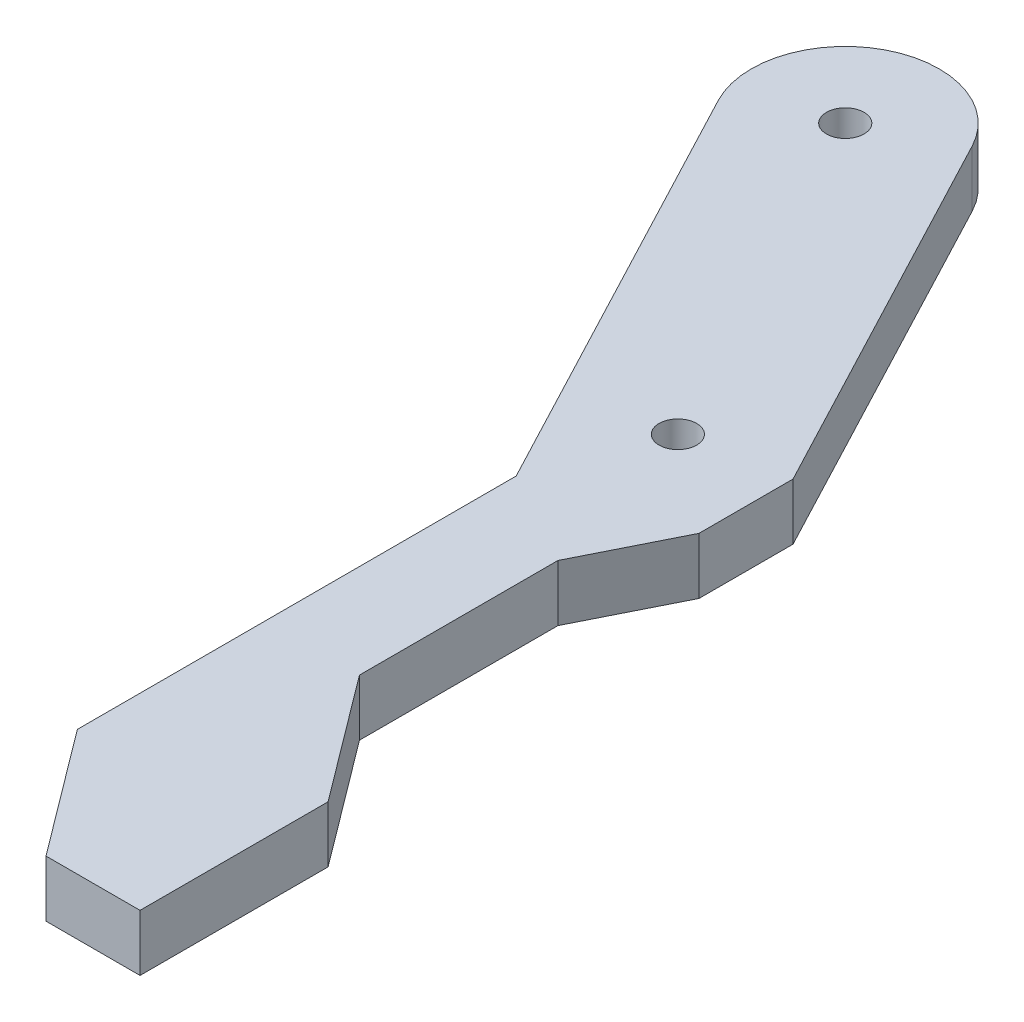
ISO-10303-21;
HEADER;
FILE_DESCRIPTION(('STEP AP214'),'2;1');
FILE_NAME('part.step','',(''),(''),'','','');
FILE_SCHEMA(('AUTOMOTIVE_DESIGN { 1 0 10303 214 1 1 1 1 }'));
ENDSEC;
DATA;
#1=APPLICATION_CONTEXT('core data for automotive mechanical design processes');
#2=APPLICATION_PROTOCOL_DEFINITION('international standard','automotive_design',2000,#1);
#3=PRODUCT_CONTEXT('',#1,'mechanical');
#4=PRODUCT('Part','Part','',(#3));
#5=PRODUCT_RELATED_PRODUCT_CATEGORY('part','',(#4));
#6=PRODUCT_DEFINITION_FORMATION('','',#4);
#7=PRODUCT_DEFINITION_CONTEXT('part definition',#1,'design');
#8=PRODUCT_DEFINITION('design','',#6,#7);
#9=PRODUCT_DEFINITION_SHAPE('','',#8);
#10=(LENGTH_UNIT() NAMED_UNIT(*) SI_UNIT(.MILLI.,.METRE.));
#11=(NAMED_UNIT(*) PLANE_ANGLE_UNIT() SI_UNIT($,.RADIAN.));
#12=(NAMED_UNIT(*) SI_UNIT($,.STERADIAN.) SOLID_ANGLE_UNIT());
#13=UNCERTAINTY_MEASURE_WITH_UNIT(LENGTH_MEASURE(1.E-05),#10,'distance_accuracy_value','');
#14=(GEOMETRIC_REPRESENTATION_CONTEXT(3) GLOBAL_UNCERTAINTY_ASSIGNED_CONTEXT((#13)) GLOBAL_UNIT_ASSIGNED_CONTEXT((#10,
#11,#12)) REPRESENTATION_CONTEXT('',''));
#15=CARTESIAN_POINT('',(0.,0.,0.));
#16=DIRECTION('',(0.,0.,1.));
#17=DIRECTION('',(1.,0.,0.));
#18=AXIS2_PLACEMENT_3D('',#15,#16,#17);
#19=CARTESIAN_POINT('',(2.49500776591133,3.,-24.5552704801839));
#20=DIRECTION('',(0.,1.,0.));
#21=DIRECTION('',(0.,0.,1.));
#22=AXIS2_PLACEMENT_3D('',#19,#20,#21);
#23=PLANE('',#22);
#24=CARTESIAN_POINT('',(12.3715323829315,3.,-5.77782737382026));
#25=DIRECTION('',(0.,1.,0.));
#26=DIRECTION('',(0.,0.,1.));
#27=AXIS2_PLACEMENT_3D('',#24,#25,#26);
#28=CIRCLE('',#27,1.);
#29=CARTESIAN_POINT('',(12.3715323829315,3.,-4.77782737382026));
#30=VERTEX_POINT('',#29);
#31=EDGE_CURVE('E152',#30,#30,#28,.T.);
#32=ORIENTED_EDGE('',*,*,#31,.F.);
#33=EDGE_LOOP('',(#32));
#34=FACE_BOUND('',#33,.T.);
#35=CARTESIAN_POINT('',(2.49500776591133,3.,-24.5552704801839));
#36=DIRECTION('',(0.,1.,0.));
#37=DIRECTION('',(0.,0.,1.));
#38=AXIS2_PLACEMENT_3D('',#35,#36,#37);
#39=CIRCLE('',#38,5.);
#40=CARTESIAN_POINT('',(6.92021453928729,3.,-26.8828325121967));
#41=VERTEX_POINT('',#40);
#42=CARTESIAN_POINT('',(-1.93019900746463,3.,-22.2277084481711));
#43=VERTEX_POINT('',#42);
#44=EDGE_CURVE('E169',#41,#43,#39,.T.);
#45=ORIENTED_EDGE('',*,*,#44,.T.);
#46=DIRECTION('',(0.465512406402558,0.,0.885041354675193));
#47=VECTOR('',#46,1.);
#48=CARTESIAN_POINT('',(-1.93019900746463,3.,-22.2277084481711));
#49=LINE('',#48,#47);
#50=CARTESIAN_POINT('',(9.99500776591133,3.,0.444729519816103));
#51=VERTEX_POINT('',#50);
#52=EDGE_CURVE('E102',#43,#51,#49,.T.);
#53=ORIENTED_EDGE('',*,*,#52,.T.);
#54=DIRECTION('',(0.,0.,1.));
#55=VECTOR('',#54,1.);
#56=CARTESIAN_POINT('',(9.99500776591133,3.,0.444729519816103));
#57=LINE('',#56,#55);
#58=CARTESIAN_POINT('',(9.99500776591134,3.,23.7780628531494));
#59=VERTEX_POINT('',#58);
#60=EDGE_CURVE('E193',#51,#59,#57,.T.);
#61=ORIENTED_EDGE('',*,*,#60,.T.);
#62=DIRECTION('',(0.6,0.,0.8));
#63=VECTOR('',#62,1.);
#64=CARTESIAN_POINT('',(9.99500776591134,3.,23.7780628531494));
#65=LINE('',#64,#63);
#66=CARTESIAN_POINT('',(14.9950077659113,3.,30.4447295198161));
#67=VERTEX_POINT('',#66);
#68=EDGE_CURVE('E212',#59,#67,#65,.T.);
#69=ORIENTED_EDGE('',*,*,#68,.T.);
#70=DIRECTION('',(1.,0.,0.));
#71=VECTOR('',#70,1.);
#72=CARTESIAN_POINT('',(14.9950077659113,3.,30.4447295198161));
#73=LINE('',#72,#71);
#74=CARTESIAN_POINT('',(19.9950077659113,3.,30.4447295198161));
#75=VERTEX_POINT('',#74);
#76=EDGE_CURVE('E209',#67,#75,#73,.T.);
#77=ORIENTED_EDGE('',*,*,#76,.T.);
#78=DIRECTION('',(0.,0.,-1.));
#79=VECTOR('',#78,1.);
#80=CARTESIAN_POINT('',(19.9950077659113,3.,30.4447295198161));
#81=LINE('',#80,#79);
#82=CARTESIAN_POINT('',(19.9950077659113,3.,20.4447295198161));
#83=VERTEX_POINT('',#82);
#84=EDGE_CURVE('E211',#75,#83,#81,.T.);
#85=ORIENTED_EDGE('',*,*,#84,.T.);
#86=DIRECTION('',(-0.6,0.,-0.8));
#87=VECTOR('',#86,1.);
#88=CARTESIAN_POINT('',(14.9950077659113,3.,13.7780628531494));
#89=LINE('',#88,#87);
#90=CARTESIAN_POINT('',(14.9950077659113,3.,13.7780628531494));
#91=VERTEX_POINT('',#90);
#92=EDGE_CURVE('E214',#83,#91,#89,.T.);
#93=ORIENTED_EDGE('',*,*,#92,.T.);
#94=DIRECTION('',(0.,0.,-1.));
#95=VECTOR('',#94,1.);
#96=CARTESIAN_POINT('',(14.9950077659113,3.,3.22217262617973));
#97=LINE('',#96,#95);
#98=CARTESIAN_POINT('',(14.9950077659113,3.,3.22217262617973));
#99=VERTEX_POINT('',#98);
#100=EDGE_CURVE('E130',#91,#99,#97,.T.);
#101=ORIENTED_EDGE('',*,*,#100,.T.);
#102=DIRECTION('',(0.447213595499958,0.,-0.894427190999916));
#103=VECTOR('',#102,1.);
#104=CARTESIAN_POINT('',(17.4950077659113,3.,-1.77782737382027));
#105=LINE('',#104,#103);
#106=CARTESIAN_POINT('',(17.4950077659113,3.,-1.77782737382027));
#107=VERTEX_POINT('',#106);
#108=EDGE_CURVE('E124',#99,#107,#105,.T.);
#109=ORIENTED_EDGE('',*,*,#108,.T.);
#110=DIRECTION('',(0.,0.,-1.));
#111=VECTOR('',#110,1.);
#112=CARTESIAN_POINT('',(17.4950077659113,3.,-6.77782737382027));
#113=LINE('',#112,#111);
#114=CARTESIAN_POINT('',(17.4950077659113,3.,-6.77782737382027));
#115=VERTEX_POINT('',#114);
#116=EDGE_CURVE('E128',#107,#115,#113,.T.);
#117=ORIENTED_EDGE('',*,*,#116,.T.);
#118=DIRECTION('',(-0.465512406402558,0.,-0.885041354675193));
#119=VECTOR('',#118,1.);
#120=CARTESIAN_POINT('',(6.92021453928729,3.,-26.8828325121967));
#121=LINE('',#120,#119);
#122=EDGE_CURVE('E50',#115,#41,#121,.T.);
#123=ORIENTED_EDGE('',*,*,#122,.T.);
#124=EDGE_LOOP('',(#45,#53,#61,#69,#77,#85,#93,#101,#109,#117,#123));
#125=FACE_BOUND('',#124,.T.);
#126=CARTESIAN_POINT('',(2.49500776591133,3.,-24.5552704801839));
#127=DIRECTION('',(0.,1.,0.));
#128=DIRECTION('',(0.,0.,1.));
#129=AXIS2_PLACEMENT_3D('',#126,#127,#128);
#130=CIRCLE('',#129,1.);
#131=CARTESIAN_POINT('',(2.49500776591133,3.,-23.5552704801839));
#132=VERTEX_POINT('',#131);
#133=EDGE_CURVE('E260',#132,#132,#130,.T.);
#134=ORIENTED_EDGE('',*,*,#133,.F.);
#135=EDGE_LOOP('',(#134));
#136=FACE_BOUND('',#135,.T.);
#137=ADVANCED_FACE('F33',(#34,#125,#136),#23,.T.);
#138=CARTESIAN_POINT('',(2.49500776591133,0.,-24.5552704801839));
#139=DIRECTION('',(0.,1.,0.));
#140=DIRECTION('',(0.,0.,1.));
#141=AXIS2_PLACEMENT_3D('',#138,#139,#140);
#142=PLANE('',#141);
#143=CARTESIAN_POINT('',(12.3715323829315,0.,-5.77782737382026));
#144=DIRECTION('',(0.,1.,0.));
#145=DIRECTION('',(0.,0.,1.));
#146=AXIS2_PLACEMENT_3D('',#143,#144,#145);
#147=CIRCLE('',#146,1.);
#148=CARTESIAN_POINT('',(12.3715323829315,0.,-4.77782737382026));
#149=VERTEX_POINT('',#148);
#150=EDGE_CURVE('E265',#149,#149,#147,.T.);
#151=ORIENTED_EDGE('',*,*,#150,.T.);
#152=EDGE_LOOP('',(#151));
#153=FACE_BOUND('',#152,.T.);
#154=CARTESIAN_POINT('',(2.49500776591133,0.,-24.5552704801839));
#155=DIRECTION('',(0.,1.,0.));
#156=DIRECTION('',(0.,0.,1.));
#157=AXIS2_PLACEMENT_3D('',#154,#155,#156);
#158=CIRCLE('',#157,5.);
#159=CARTESIAN_POINT('',(6.92021453928729,0.,-26.8828325121967));
#160=VERTEX_POINT('',#159);
#161=CARTESIAN_POINT('',(-1.93019900746463,0.,-22.2277084481711));
#162=VERTEX_POINT('',#161);
#163=EDGE_CURVE('E148',#160,#162,#158,.T.);
#164=ORIENTED_EDGE('',*,*,#163,.F.);
#165=DIRECTION('',(-0.465512406402558,0.,-0.885041354675193));
#166=VECTOR('',#165,1.);
#167=CARTESIAN_POINT('',(6.92021453928729,0.,-26.8828325121967));
#168=LINE('',#167,#166);
#169=CARTESIAN_POINT('',(17.4950077659113,0.,-6.77782737382027));
#170=VERTEX_POINT('',#169);
#171=EDGE_CURVE('E94',#170,#160,#168,.T.);
#172=ORIENTED_EDGE('',*,*,#171,.F.);
#173=DIRECTION('',(0.,0.,-1.));
#174=VECTOR('',#173,1.);
#175=CARTESIAN_POINT('',(17.4950077659113,0.,-6.77782737382027));
#176=LINE('',#175,#174);
#177=CARTESIAN_POINT('',(17.4950077659113,0.,-1.77782737382027));
#178=VERTEX_POINT('',#177);
#179=EDGE_CURVE('E88',#178,#170,#176,.T.);
#180=ORIENTED_EDGE('',*,*,#179,.F.);
#181=DIRECTION('',(0.447213595499958,0.,-0.894427190999916));
#182=VECTOR('',#181,1.);
#183=CARTESIAN_POINT('',(17.4950077659113,0.,-1.77782737382027));
#184=LINE('',#183,#182);
#185=CARTESIAN_POINT('',(14.9950077659113,0.,3.22217262617973));
#186=VERTEX_POINT('',#185);
#187=EDGE_CURVE('E138',#186,#178,#184,.T.);
#188=ORIENTED_EDGE('',*,*,#187,.F.);
#189=DIRECTION('',(0.,0.,-1.));
#190=VECTOR('',#189,1.);
#191=CARTESIAN_POINT('',(14.9950077659113,0.,3.22217262617973));
#192=LINE('',#191,#190);
#193=CARTESIAN_POINT('',(14.9950077659113,0.,13.7780628531494));
#194=VERTEX_POINT('',#193);
#195=EDGE_CURVE('E164',#194,#186,#192,.T.);
#196=ORIENTED_EDGE('',*,*,#195,.F.);
#197=DIRECTION('',(-0.6,0.,-0.8));
#198=VECTOR('',#197,1.);
#199=CARTESIAN_POINT('',(14.9950077659113,0.,13.7780628531494));
#200=LINE('',#199,#198);
#201=CARTESIAN_POINT('',(19.9950077659113,0.,20.4447295198161));
#202=VERTEX_POINT('',#201);
#203=EDGE_CURVE('E162',#202,#194,#200,.T.);
#204=ORIENTED_EDGE('',*,*,#203,.F.);
#205=DIRECTION('',(0.,0.,-1.));
#206=VECTOR('',#205,1.);
#207=CARTESIAN_POINT('',(19.9950077659113,0.,30.4447295198161));
#208=LINE('',#207,#206);
#209=CARTESIAN_POINT('',(19.9950077659113,0.,30.4447295198161));
#210=VERTEX_POINT('',#209);
#211=EDGE_CURVE('E160',#210,#202,#208,.T.);
#212=ORIENTED_EDGE('',*,*,#211,.F.);
#213=DIRECTION('',(1.,0.,0.));
#214=VECTOR('',#213,1.);
#215=CARTESIAN_POINT('',(14.9950077659113,0.,30.4447295198161));
#216=LINE('',#215,#214);
#217=CARTESIAN_POINT('',(14.9950077659113,0.,30.4447295198161));
#218=VERTEX_POINT('',#217);
#219=EDGE_CURVE('E158',#218,#210,#216,.T.);
#220=ORIENTED_EDGE('',*,*,#219,.F.);
#221=DIRECTION('',(0.6,0.,0.8));
#222=VECTOR('',#221,1.);
#223=CARTESIAN_POINT('',(9.99500776591134,0.,23.7780628531494));
#224=LINE('',#223,#222);
#225=CARTESIAN_POINT('',(9.99500776591134,0.,23.7780628531494));
#226=VERTEX_POINT('',#225);
#227=EDGE_CURVE('E156',#226,#218,#224,.T.);
#228=ORIENTED_EDGE('',*,*,#227,.F.);
#229=DIRECTION('',(0.,0.,1.));
#230=VECTOR('',#229,1.);
#231=CARTESIAN_POINT('',(9.99500776591133,0.,0.444729519816103));
#232=LINE('',#231,#230);
#233=CARTESIAN_POINT('',(9.99500776591133,0.,0.444729519816103));
#234=VERTEX_POINT('',#233);
#235=EDGE_CURVE('E154',#234,#226,#232,.T.);
#236=ORIENTED_EDGE('',*,*,#235,.F.);
#237=DIRECTION('',(0.465512406402558,0.,0.885041354675193));
#238=VECTOR('',#237,1.);
#239=CARTESIAN_POINT('',(-1.93019900746463,0.,-22.2277084481711));
#240=LINE('',#239,#238);
#241=EDGE_CURVE('E151',#162,#234,#240,.T.);
#242=ORIENTED_EDGE('',*,*,#241,.F.);
#243=EDGE_LOOP('',(#164,#172,#180,#188,#196,#204,#212,#220,#228,#236,#242));
#244=FACE_BOUND('',#243,.T.);
#245=CARTESIAN_POINT('',(2.49500776591133,0.,-24.5552704801839));
#246=DIRECTION('',(0.,1.,0.));
#247=DIRECTION('',(0.,0.,1.));
#248=AXIS2_PLACEMENT_3D('',#245,#246,#247);
#249=CIRCLE('',#248,1.);
#250=CARTESIAN_POINT('',(2.49500776591133,0.,-23.5552704801839));
#251=VERTEX_POINT('',#250);
#252=EDGE_CURVE('E263',#251,#251,#249,.T.);
#253=ORIENTED_EDGE('',*,*,#252,.T.);
#254=EDGE_LOOP('',(#253));
#255=FACE_BOUND('',#254,.T.);
#256=ADVANCED_FACE('F197',(#153,#244,#255),#142,.F.);
#257=CARTESIAN_POINT('',(2.49500776591133,3.,-24.5552704801839));
#258=DIRECTION('',(0.,-1.,0.));
#259=DIRECTION('',(0.,0.,-1.));
#260=AXIS2_PLACEMENT_3D('',#257,#258,#259);
#261=CYLINDRICAL_SURFACE('',#260,5.);
#262=ORIENTED_EDGE('',*,*,#163,.T.);
#263=DIRECTION('',(0.,-1.,0.));
#264=VECTOR('',#263,1.);
#265=CARTESIAN_POINT('',(-1.93019900746463,3.,-22.2277084481711));
#266=LINE('',#265,#264);
#267=EDGE_CURVE('E11',#43,#162,#266,.T.);
#268=ORIENTED_EDGE('',*,*,#267,.F.);
#269=ORIENTED_EDGE('',*,*,#44,.F.);
#270=DIRECTION('',(0.,-1.,0.));
#271=VECTOR('',#270,1.);
#272=CARTESIAN_POINT('',(6.92021453928729,3.,-26.8828325121967));
#273=LINE('',#272,#271);
#274=EDGE_CURVE('E144',#41,#160,#273,.T.);
#275=ORIENTED_EDGE('',*,*,#274,.T.);
#276=EDGE_LOOP('',(#262,#268,#269,#275));
#277=FACE_BOUND('',#276,.T.);
#278=ADVANCED_FACE('F35',(#277),#261,.T.);
#279=CARTESIAN_POINT('',(-1.93019900746463,3.,-22.2277084481711));
#280=DIRECTION('',(0.885041354675192,0.,-0.465512406402558));
#281=DIRECTION('',(-0.465512406402558,0.,-0.885041354675193));
#282=AXIS2_PLACEMENT_3D('',#279,#280,#281);
#283=PLANE('',#282);
#284=ORIENTED_EDGE('',*,*,#241,.T.);
#285=DIRECTION('',(0.,-1.,0.));
#286=VECTOR('',#285,1.);
#287=CARTESIAN_POINT('',(9.99500776591133,3.,0.444729519816103));
#288=LINE('',#287,#286);
#289=EDGE_CURVE('E42',#51,#234,#288,.T.);
#290=ORIENTED_EDGE('',*,*,#289,.F.);
#291=ORIENTED_EDGE('',*,*,#52,.F.);
#292=ORIENTED_EDGE('',*,*,#267,.T.);
#293=EDGE_LOOP('',(#284,#290,#291,#292));
#294=FACE_BOUND('',#293,.T.);
#295=ADVANCED_FACE('F348',(#294),#283,.F.);
#296=CARTESIAN_POINT('',(9.99500776591133,3.,0.444729519816103));
#297=DIRECTION('',(1.,0.,0.));
#298=DIRECTION('',(0.,0.,-1.));
#299=AXIS2_PLACEMENT_3D('',#296,#297,#298);
#300=PLANE('',#299);
#301=ORIENTED_EDGE('',*,*,#235,.T.);
#302=DIRECTION('',(0.,-1.,0.));
#303=VECTOR('',#302,1.);
#304=CARTESIAN_POINT('',(9.99500776591134,3.,23.7780628531494));
#305=LINE('',#304,#303);
#306=EDGE_CURVE('E185',#59,#226,#305,.T.);
#307=ORIENTED_EDGE('',*,*,#306,.F.);
#308=ORIENTED_EDGE('',*,*,#60,.F.);
#309=ORIENTED_EDGE('',*,*,#289,.T.);
#310=EDGE_LOOP('',(#301,#307,#308,#309));
#311=FACE_BOUND('',#310,.T.);
#312=ADVANCED_FACE('F191',(#311),#300,.F.);
#313=CARTESIAN_POINT('',(9.99500776591134,3.,23.7780628531494));
#314=DIRECTION('',(0.8,0.,-0.6));
#315=DIRECTION('',(-0.6,0.,-0.8));
#316=AXIS2_PLACEMENT_3D('',#313,#314,#315);
#317=PLANE('',#316);
#318=ORIENTED_EDGE('',*,*,#227,.T.);
#319=DIRECTION('',(0.,-1.,0.));
#320=VECTOR('',#319,1.);
#321=CARTESIAN_POINT('',(14.9950077659113,3.,30.4447295198161));
#322=LINE('',#321,#320);
#323=EDGE_CURVE('E182',#67,#218,#322,.T.);
#324=ORIENTED_EDGE('',*,*,#323,.F.);
#325=ORIENTED_EDGE('',*,*,#68,.F.);
#326=ORIENTED_EDGE('',*,*,#306,.T.);
#327=EDGE_LOOP('',(#318,#324,#325,#326));
#328=FACE_BOUND('',#327,.T.);
#329=ADVANCED_FACE('F203',(#328),#317,.F.);
#330=CARTESIAN_POINT('',(14.9950077659113,3.,30.4447295198161));
#331=DIRECTION('',(0.,0.,-1.));
#332=DIRECTION('',(-1.,0.,0.));
#333=AXIS2_PLACEMENT_3D('',#330,#331,#332);
#334=PLANE('',#333);
#335=ORIENTED_EDGE('',*,*,#219,.T.);
#336=DIRECTION('',(0.,-1.,0.));
#337=VECTOR('',#336,1.);
#338=CARTESIAN_POINT('',(19.9950077659113,3.,30.4447295198161));
#339=LINE('',#338,#337);
#340=EDGE_CURVE('E179',#75,#210,#339,.T.);
#341=ORIENTED_EDGE('',*,*,#340,.F.);
#342=ORIENTED_EDGE('',*,*,#76,.F.);
#343=ORIENTED_EDGE('',*,*,#323,.T.);
#344=EDGE_LOOP('',(#335,#341,#342,#343));
#345=FACE_BOUND('',#344,.T.);
#346=ADVANCED_FACE('F207',(#345),#334,.F.);
#347=CARTESIAN_POINT('',(19.9950077659113,3.,30.4447295198161));
#348=DIRECTION('',(-1.,0.,0.));
#349=DIRECTION('',(0.,0.,1.));
#350=AXIS2_PLACEMENT_3D('',#347,#348,#349);
#351=PLANE('',#350);
#352=ORIENTED_EDGE('',*,*,#211,.T.);
#353=DIRECTION('',(0.,-1.,0.));
#354=VECTOR('',#353,1.);
#355=CARTESIAN_POINT('',(19.9950077659113,3.,20.4447295198161));
#356=LINE('',#355,#354);
#357=EDGE_CURVE('E176',#83,#202,#356,.T.);
#358=ORIENTED_EDGE('',*,*,#357,.F.);
#359=ORIENTED_EDGE('',*,*,#84,.F.);
#360=ORIENTED_EDGE('',*,*,#340,.T.);
#361=EDGE_LOOP('',(#352,#358,#359,#360));
#362=FACE_BOUND('',#361,.T.);
#363=ADVANCED_FACE('F314',(#362),#351,.F.);
#364=CARTESIAN_POINT('',(14.9950077659113,3.,13.7780628531494));
#365=DIRECTION('',(-0.8,0.,0.6));
#366=DIRECTION('',(0.6,0.,0.8));
#367=AXIS2_PLACEMENT_3D('',#364,#365,#366);
#368=PLANE('',#367);
#369=ORIENTED_EDGE('',*,*,#203,.T.);
#370=DIRECTION('',(0.,-1.,0.));
#371=VECTOR('',#370,1.);
#372=CARTESIAN_POINT('',(14.9950077659113,3.,13.7780628531494));
#373=LINE('',#372,#371);
#374=EDGE_CURVE('E173',#91,#194,#373,.T.);
#375=ORIENTED_EDGE('',*,*,#374,.F.);
#376=ORIENTED_EDGE('',*,*,#92,.F.);
#377=ORIENTED_EDGE('',*,*,#357,.T.);
#378=EDGE_LOOP('',(#369,#375,#376,#377));
#379=FACE_BOUND('',#378,.T.);
#380=ADVANCED_FACE('F223',(#379),#368,.F.);
#381=CARTESIAN_POINT('',(14.9950077659113,3.,3.22217262617973));
#382=DIRECTION('',(-1.,0.,0.));
#383=DIRECTION('',(0.,0.,1.));
#384=AXIS2_PLACEMENT_3D('',#381,#382,#383);
#385=PLANE('',#384);
#386=ORIENTED_EDGE('',*,*,#195,.T.);
#387=DIRECTION('',(0.,-1.,0.));
#388=VECTOR('',#387,1.);
#389=CARTESIAN_POINT('',(14.9950077659113,3.,3.22217262617973));
#390=LINE('',#389,#388);
#391=EDGE_CURVE('E139',#99,#186,#390,.T.);
#392=ORIENTED_EDGE('',*,*,#391,.F.);
#393=ORIENTED_EDGE('',*,*,#100,.F.);
#394=ORIENTED_EDGE('',*,*,#374,.T.);
#395=EDGE_LOOP('',(#386,#392,#393,#394));
#396=FACE_BOUND('',#395,.T.);
#397=ADVANCED_FACE('F227',(#396),#385,.F.);
#398=CARTESIAN_POINT('',(17.4950077659113,3.,-1.77782737382027));
#399=DIRECTION('',(-0.894427190999916,0.,-0.447213595499958));
#400=DIRECTION('',(-0.447213595499958,0.,0.894427190999916));
#401=AXIS2_PLACEMENT_3D('',#398,#399,#400);
#402=PLANE('',#401);
#403=ORIENTED_EDGE('',*,*,#187,.T.);
#404=DIRECTION('',(0.,-1.,0.));
#405=VECTOR('',#404,1.);
#406=CARTESIAN_POINT('',(17.4950077659113,3.,-1.77782737382027));
#407=LINE('',#406,#405);
#408=EDGE_CURVE('E135',#107,#178,#407,.T.);
#409=ORIENTED_EDGE('',*,*,#408,.F.);
#410=ORIENTED_EDGE('',*,*,#108,.F.);
#411=ORIENTED_EDGE('',*,*,#391,.T.);
#412=EDGE_LOOP('',(#403,#409,#410,#411));
#413=FACE_BOUND('',#412,.T.);
#414=ADVANCED_FACE('F136',(#413),#402,.F.);
#415=CARTESIAN_POINT('',(17.4950077659113,3.,-6.77782737382027));
#416=DIRECTION('',(-1.,0.,0.));
#417=DIRECTION('',(0.,0.,1.));
#418=AXIS2_PLACEMENT_3D('',#415,#416,#417);
#419=PLANE('',#418);
#420=ORIENTED_EDGE('',*,*,#179,.T.);
#421=DIRECTION('',(0.,-1.,0.));
#422=VECTOR('',#421,1.);
#423=CARTESIAN_POINT('',(17.4950077659113,3.,-6.77782737382027));
#424=LINE('',#423,#422);
#425=EDGE_CURVE('E140',#115,#170,#424,.T.);
#426=ORIENTED_EDGE('',*,*,#425,.F.);
#427=ORIENTED_EDGE('',*,*,#116,.F.);
#428=ORIENTED_EDGE('',*,*,#408,.T.);
#429=EDGE_LOOP('',(#420,#426,#427,#428));
#430=FACE_BOUND('',#429,.T.);
#431=ADVANCED_FACE('F142',(#430),#419,.F.);
#432=CARTESIAN_POINT('',(6.92021453928729,3.,-26.8828325121967));
#433=DIRECTION('',(-0.885041354675192,0.,0.465512406402558));
#434=DIRECTION('',(0.465512406402558,0.,0.885041354675193));
#435=AXIS2_PLACEMENT_3D('',#432,#433,#434);
#436=PLANE('',#435);
#437=ORIENTED_EDGE('',*,*,#171,.T.);
#438=ORIENTED_EDGE('',*,*,#274,.F.);
#439=ORIENTED_EDGE('',*,*,#122,.F.);
#440=ORIENTED_EDGE('',*,*,#425,.T.);
#441=EDGE_LOOP('',(#437,#438,#439,#440));
#442=FACE_BOUND('',#441,.T.);
#443=ADVANCED_FACE('F231',(#442),#436,.F.);
#444=CARTESIAN_POINT('',(12.3715323829315,3.,-5.77782737382026));
#445=DIRECTION('',(0.,-1.,0.));
#446=DIRECTION('',(0.,0.,-1.));
#447=AXIS2_PLACEMENT_3D('',#444,#445,#446);
#448=CYLINDRICAL_SURFACE('',#447,1.);
#449=ORIENTED_EDGE('',*,*,#31,.T.);
#450=EDGE_LOOP('',(#449));
#451=FACE_BOUND('',#450,.T.);
#452=ORIENTED_EDGE('',*,*,#150,.F.);
#453=EDGE_LOOP('',(#452));
#454=FACE_BOUND('',#453,.T.);
#455=ADVANCED_FACE('F233',(#451,#454),#448,.F.);
#456=CARTESIAN_POINT('',(2.49500776591133,3.,-24.5552704801839));
#457=DIRECTION('',(0.,-1.,0.));
#458=DIRECTION('',(0.,0.,-1.));
#459=AXIS2_PLACEMENT_3D('',#456,#457,#458);
#460=CYLINDRICAL_SURFACE('',#459,1.);
#461=ORIENTED_EDGE('',*,*,#133,.T.);
#462=EDGE_LOOP('',(#461));
#463=FACE_BOUND('',#462,.T.);
#464=ORIENTED_EDGE('',*,*,#252,.F.);
#465=EDGE_LOOP('',(#464));
#466=FACE_BOUND('',#465,.T.);
#467=ADVANCED_FACE('F239',(#463,#466),#460,.F.);
#468=CLOSED_SHELL('',(#137,#256,#278,#295,#312,#329,#346,#363,#380,#397,#414,#431,#443,#455,#467));
#469=MANIFOLD_SOLID_BREP('B2',#468);
#470=ADVANCED_BREP_SHAPE_REPRESENTATION('',(#18,#469),#14);
#471=SHAPE_DEFINITION_REPRESENTATION(#9,#470);
ENDSEC;
END-ISO-10303-21;
